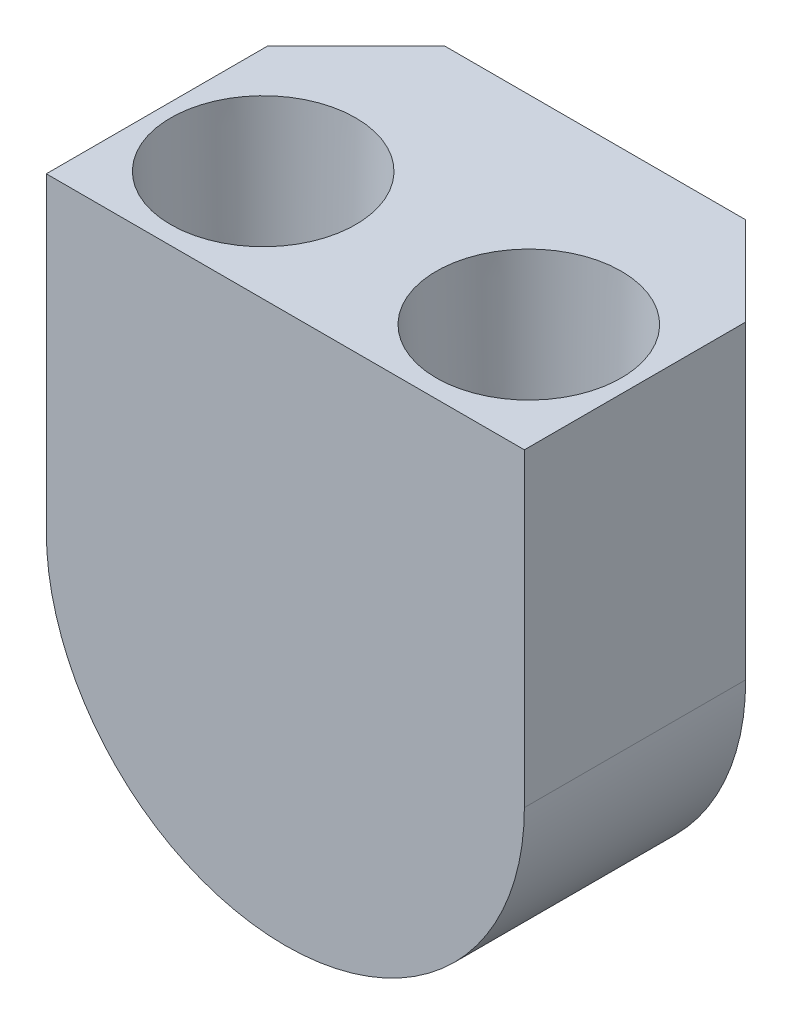
ISO-10303-21;
HEADER;
FILE_DESCRIPTION(('STEP AP214'),'2;1');
FILE_NAME('part.step','',(''),(''),'','','');
FILE_SCHEMA(('AUTOMOTIVE_DESIGN { 1 0 10303 214 1 1 1 1 }'));
ENDSEC;
DATA;
#1=APPLICATION_CONTEXT('core data for automotive mechanical design processes');
#2=APPLICATION_PROTOCOL_DEFINITION('international standard','automotive_design',2000,#1);
#3=PRODUCT_CONTEXT('',#1,'mechanical');
#4=PRODUCT('Part','Part','',(#3));
#5=PRODUCT_RELATED_PRODUCT_CATEGORY('part','',(#4));
#6=PRODUCT_DEFINITION_FORMATION('','',#4);
#7=PRODUCT_DEFINITION_CONTEXT('part definition',#1,'design');
#8=PRODUCT_DEFINITION('design','',#6,#7);
#9=PRODUCT_DEFINITION_SHAPE('','',#8);
#10=(LENGTH_UNIT() NAMED_UNIT(*) SI_UNIT(.MILLI.,.METRE.));
#11=(NAMED_UNIT(*) PLANE_ANGLE_UNIT() SI_UNIT($,.RADIAN.));
#12=(NAMED_UNIT(*) SI_UNIT($,.STERADIAN.) SOLID_ANGLE_UNIT());
#13=UNCERTAINTY_MEASURE_WITH_UNIT(LENGTH_MEASURE(1.E-05),#10,'distance_accuracy_value','');
#14=(GEOMETRIC_REPRESENTATION_CONTEXT(3) GLOBAL_UNCERTAINTY_ASSIGNED_CONTEXT((#13)) GLOBAL_UNIT_ASSIGNED_CONTEXT((#10,
#11,#12)) REPRESENTATION_CONTEXT('',''));
#15=CARTESIAN_POINT('',(0.,0.,0.));
#16=DIRECTION('',(0.,0.,1.));
#17=DIRECTION('',(1.,0.,0.));
#18=AXIS2_PLACEMENT_3D('',#15,#16,#17);
#19=CARTESIAN_POINT('',(15.7034932043588,8.33838720500601,-8.89000000000006));
#20=DIRECTION('',(0.,0.,-0.999999999999991));
#21=DIRECTION('',(-0.468975658324345,0.883211091358825,0.));
#22=AXIS2_PLACEMENT_3D('',#19,#20,#21);
#23=PLANE('',#22);
#24=CARTESIAN_POINT('',(-0.837419567709552,0.268318359393671,-8.89000000000006));
#25=DIRECTION('',(0.,0.,-0.999999999999991));
#26=DIRECTION('',(0.,1.,0.));
#27=AXIS2_PLACEMENT_3D('',#24,#25,#26);
#28=CIRCLE('',#27,4.31799999999999);
#29=CARTESIAN_POINT('',(3.48058043229043,0.268318359393671,-8.89000000000006));
#30=VERTEX_POINT('',#29);
#31=CARTESIAN_POINT('',(-5.15541956770954,0.268318359393671,-8.89000000000006));
#32=VERTEX_POINT('',#31);
#33=EDGE_CURVE('E149',#30,#32,#28,.T.);
#34=ORIENTED_EDGE('',*,*,#33,.T.);
#35=DIRECTION('',(0.,1.,0.));
#36=VECTOR('',#35,1.);
#37=CARTESIAN_POINT('',(-5.15541956770954,8.33838720500601,-8.89000000000006));
#38=LINE('',#37,#36);
#39=CARTESIAN_POINT('',(-5.15541956770954,9.15831835939374,-8.89000000000006));
#40=VERTEX_POINT('',#39);
#41=EDGE_CURVE('E151',#32,#40,#38,.T.);
#42=ORIENTED_EDGE('',*,*,#41,.T.);
#43=DIRECTION('',(-1.,0.,0.));
#44=VECTOR('',#43,1.);
#45=CARTESIAN_POINT('',(6.02058043229044,9.15831835939374,-8.89000000000006));
#46=LINE('',#45,#44);
#47=CARTESIAN_POINT('',(3.48058043229043,9.15831835939374,-8.89000000000006));
#48=VERTEX_POINT('',#47);
#49=EDGE_CURVE('E118',#48,#40,#46,.T.);
#50=ORIENTED_EDGE('',*,*,#49,.F.);
#51=DIRECTION('',(0.,-1.,0.));
#52=VECTOR('',#51,1.);
#53=CARTESIAN_POINT('',(3.48058043229043,8.33838720500601,-8.89000000000006));
#54=LINE('',#53,#52);
#55=EDGE_CURVE('E147',#48,#30,#54,.T.);
#56=ORIENTED_EDGE('',*,*,#55,.T.);
#57=EDGE_LOOP('',(#34,#42,#50,#56));
#58=FACE_BOUND('',#57,.T.);
#59=ADVANCED_FACE('F53',(#58),#23,.T.);
#60=CARTESIAN_POINT('',(-0.837419567709552,0.268318359393671,0.));
#61=DIRECTION('',(0.,0.,0.999999999999992));
#62=DIRECTION('',(1.,0.,0.));
#63=AXIS2_PLACEMENT_3D('',#60,#61,#62);
#64=PLANE('',#63);
#65=DIRECTION('',(0.,-1.,0.));
#66=VECTOR('',#65,1.);
#67=CARTESIAN_POINT('',(-7.69541956770955,9.15831835939374,0.));
#68=LINE('',#67,#66);
#69=CARTESIAN_POINT('',(-7.69541956770955,9.15831835939374,0.));
#70=VERTEX_POINT('',#69);
#71=CARTESIAN_POINT('',(-7.69541956770955,0.268318359393671,0.));
#72=VERTEX_POINT('',#71);
#73=EDGE_CURVE('E121',#70,#72,#68,.T.);
#74=ORIENTED_EDGE('',*,*,#73,.T.);
#75=CARTESIAN_POINT('',(-0.837419567709552,0.268318359393671,0.));
#76=DIRECTION('',(0.,0.,0.999999999999992));
#77=DIRECTION('',(1.,0.,0.));
#78=AXIS2_PLACEMENT_3D('',#75,#76,#77);
#79=CIRCLE('',#78,6.85799999999999);
#80=CARTESIAN_POINT('',(6.02058043229044,0.268318359393671,0.));
#81=VERTEX_POINT('',#80);
#82=EDGE_CURVE('E126',#72,#81,#79,.T.);
#83=ORIENTED_EDGE('',*,*,#82,.T.);
#84=DIRECTION('',(0.,1.,0.));
#85=VECTOR('',#84,1.);
#86=CARTESIAN_POINT('',(6.02058043229044,0.268318359393671,0.));
#87=LINE('',#86,#85);
#88=CARTESIAN_POINT('',(6.02058043229044,9.15831835939374,0.));
#89=VERTEX_POINT('',#88);
#90=EDGE_CURVE('E131',#81,#89,#87,.T.);
#91=ORIENTED_EDGE('',*,*,#90,.T.);
#92=DIRECTION('',(-1.,0.,0.));
#93=VECTOR('',#92,1.);
#94=CARTESIAN_POINT('',(6.02058043229044,9.15831835939374,0.));
#95=LINE('',#94,#93);
#96=EDGE_CURVE('E111',#89,#70,#95,.T.);
#97=ORIENTED_EDGE('',*,*,#96,.T.);
#98=EDGE_LOOP('',(#74,#83,#91,#97));
#99=FACE_BOUND('',#98,.T.);
#100=ADVANCED_FACE('F129',(#99),#64,.T.);
#101=CARTESIAN_POINT('',(-0.837419567709552,0.268318359393671,-33.5836816677517));
#102=DIRECTION('',(0.,0.,0.999999999999992));
#103=DIRECTION('',(1.,0.,0.));
#104=AXIS2_PLACEMENT_3D('',#101,#102,#103);
#105=CYLINDRICAL_SURFACE('',#104,6.85799999999999);
#106=DIRECTION('',(0.,0.,0.999999999999992));
#107=VECTOR('',#106,1.);
#108=CARTESIAN_POINT('',(-7.69541956770955,0.268318359393671,-33.5836816677517));
#109=LINE('',#108,#107);
#110=CARTESIAN_POINT('',(-7.69541956770955,0.268318359393671,-6.3500000000003));
#111=VERTEX_POINT('',#110);
#112=EDGE_CURVE('E117',#111,#72,#109,.T.);
#113=ORIENTED_EDGE('',*,*,#112,.F.);
#114=CARTESIAN_POINT('',(-0.837419567709552,0.268318359393671,-6.3500000000003));
#115=DIRECTION('',(0.,0.,-0.999999999999992));
#116=DIRECTION('',(-1.,0.,0.));
#117=AXIS2_PLACEMENT_3D('',#114,#115,#116);
#118=CIRCLE('',#117,6.85799999999999);
#119=CARTESIAN_POINT('',(6.02058043229044,0.268318359393671,-6.3500000000003));
#120=VERTEX_POINT('',#119);
#121=EDGE_CURVE('E62',#111,#120,#118,.F.);
#122=ORIENTED_EDGE('',*,*,#121,.T.);
#123=DIRECTION('',(0.,0.,0.999999999999992));
#124=VECTOR('',#123,1.);
#125=CARTESIAN_POINT('',(6.02058043229044,0.268318359393671,-33.5836816677517));
#126=LINE('',#125,#124);
#127=EDGE_CURVE('E132',#120,#81,#126,.T.);
#128=ORIENTED_EDGE('',*,*,#127,.T.);
#129=ORIENTED_EDGE('',*,*,#82,.F.);
#130=EDGE_LOOP('',(#113,#122,#128,#129));
#131=FACE_BOUND('',#130,.T.);
#132=ADVANCED_FACE('F187',(#131),#105,.T.);
#133=CARTESIAN_POINT('',(6.02058043229044,0.268318359393671,-33.5836816677517));
#134=DIRECTION('',(1.,0.,0.));
#135=DIRECTION('',(0.,1.,0.));
#136=AXIS2_PLACEMENT_3D('',#133,#134,#135);
#137=PLANE('',#136);
#138=ORIENTED_EDGE('',*,*,#127,.F.);
#139=DIRECTION('',(0.,1.,0.));
#140=VECTOR('',#139,1.);
#141=CARTESIAN_POINT('',(6.02058043229044,0.268318359393671,-6.3500000000003));
#142=LINE('',#141,#140);
#143=CARTESIAN_POINT('',(6.02058043229044,9.15831835939374,-6.3500000000003));
#144=VERTEX_POINT('',#143);
#145=EDGE_CURVE('E14',#120,#144,#142,.T.);
#146=ORIENTED_EDGE('',*,*,#145,.T.);
#147=DIRECTION('',(0.,0.,0.999999999999992));
#148=VECTOR('',#147,1.);
#149=CARTESIAN_POINT('',(6.02058043229044,9.15831835939374,-33.5836816677517));
#150=LINE('',#149,#148);
#151=EDGE_CURVE('E134',#144,#89,#150,.T.);
#152=ORIENTED_EDGE('',*,*,#151,.T.);
#153=ORIENTED_EDGE('',*,*,#90,.F.);
#154=EDGE_LOOP('',(#138,#146,#152,#153));
#155=FACE_BOUND('',#154,.T.);
#156=ADVANCED_FACE('F180',(#155),#137,.T.);
#157=CARTESIAN_POINT('',(6.02058043229044,9.15831835939374,-33.5836816677517));
#158=DIRECTION('',(0.,1.,0.));
#159=DIRECTION('',(-1.,0.,0.));
#160=AXIS2_PLACEMENT_3D('',#157,#158,#159);
#161=PLANE('',#160);
#162=CARTESIAN_POINT('',(2.97258043224281,9.15831835939374,-3.17499999999971));
#163=DIRECTION('',(0.,1.,0.));
#164=DIRECTION('',(0.,0.,0.999999999999992));
#165=AXIS2_PLACEMENT_3D('',#162,#163,#164);
#166=CIRCLE('',#165,2.65430000000001);
#167=CARTESIAN_POINT('',(2.97258043224281,9.15831835939374,-0.520699999999717));
#168=VERTEX_POINT('',#167);
#169=EDGE_CURVE('E170',#168,#168,#166,.T.);
#170=ORIENTED_EDGE('',*,*,#169,.F.);
#171=EDGE_LOOP('',(#170));
#172=FACE_BOUND('',#171,.T.);
#173=CARTESIAN_POINT('',(-4.64741956775718,9.15831835939374,-3.17499999999971));
#174=DIRECTION('',(0.,1.,0.));
#175=DIRECTION('',(0.,0.,0.999999999999992));
#176=AXIS2_PLACEMENT_3D('',#173,#174,#175);
#177=CIRCLE('',#176,2.65430000000001);
#178=CARTESIAN_POINT('',(-4.64741956775718,9.15831835939374,-0.520699999999716));
#179=VERTEX_POINT('',#178);
#180=EDGE_CURVE('E162',#179,#179,#177,.T.);
#181=ORIENTED_EDGE('',*,*,#180,.F.);
#182=EDGE_LOOP('',(#181));
#183=FACE_BOUND('',#182,.T.);
#184=ORIENTED_EDGE('',*,*,#49,.T.);
#185=DIRECTION('',(0.707106781186549,0.,-0.707106781186542));
#186=VECTOR('',#185,1.);
#187=CARTESIAN_POINT('',(12.7794212661665,9.15831835939374,-26.8248408338758));
#188=LINE('',#187,#186);
#189=CARTESIAN_POINT('',(-7.69541956770955,9.15831835939374,-6.3500000000003));
#190=VERTEX_POINT('',#189);
#191=EDGE_CURVE('E113',#40,#190,#188,.F.);
#192=ORIENTED_EDGE('',*,*,#191,.T.);
#193=DIRECTION('',(0.,0.,0.999999999999992));
#194=VECTOR('',#193,1.);
#195=CARTESIAN_POINT('',(-7.69541956770955,9.15831835939374,-33.5836816677517));
#196=LINE('',#195,#194);
#197=EDGE_CURVE('E106',#190,#70,#196,.T.);
#198=ORIENTED_EDGE('',*,*,#197,.T.);
#199=ORIENTED_EDGE('',*,*,#96,.F.);
#200=ORIENTED_EDGE('',*,*,#151,.F.);
#201=DIRECTION('',(0.707106781186549,0.,0.707106781186542));
#202=VECTOR('',#201,1.);
#203=CARTESIAN_POINT('',(-7.59626040158554,9.15831835939374,-19.9668408338756));
#204=LINE('',#203,#202);
#205=EDGE_CURVE('E153',#144,#48,#204,.F.);
#206=ORIENTED_EDGE('',*,*,#205,.T.);
#207=EDGE_LOOP('',(#184,#192,#198,#199,#200,#206));
#208=FACE_BOUND('',#207,.T.);
#209=ADVANCED_FACE('F109',(#172,#183,#208),#161,.T.);
#210=CARTESIAN_POINT('',(-7.69541956770955,9.15831835939374,-33.5836816677517));
#211=DIRECTION('',(-1.,0.,0.));
#212=DIRECTION('',(0.,0.,0.999999999999992));
#213=AXIS2_PLACEMENT_3D('',#210,#211,#212);
#214=PLANE('',#213);
#215=ORIENTED_EDGE('',*,*,#197,.F.);
#216=DIRECTION('',(0.,-1.,0.));
#217=VECTOR('',#216,1.);
#218=CARTESIAN_POINT('',(-7.69541956770955,9.15831835939374,-6.3500000000003));
#219=LINE('',#218,#217);
#220=EDGE_CURVE('E145',#190,#111,#219,.T.);
#221=ORIENTED_EDGE('',*,*,#220,.T.);
#222=ORIENTED_EDGE('',*,*,#112,.T.);
#223=ORIENTED_EDGE('',*,*,#73,.F.);
#224=EDGE_LOOP('',(#215,#221,#222,#223));
#225=FACE_BOUND('',#224,.T.);
#226=ADVANCED_FACE('F122',(#225),#214,.T.);
#227=CARTESIAN_POINT('',(6.02058043229044,0.268318359393671,-6.3500000000003));
#228=DIRECTION('',(-0.707106781186546,0.,0.707106781186545));
#229=DIRECTION('',(0.,1.,0.));
#230=AXIS2_PLACEMENT_3D('',#227,#228,#229);
#231=PLANE('',#230);
#232=ORIENTED_EDGE('',*,*,#205,.F.);
#233=ORIENTED_EDGE('',*,*,#145,.F.);
#234=DIRECTION('',(0.707106781186549,0.,0.707106781186542));
#235=VECTOR('',#234,1.);
#236=CARTESIAN_POINT('',(3.48058043229043,0.268318359393671,-8.89000000000006));
#237=LINE('',#236,#235);
#238=EDGE_CURVE('E57',#30,#120,#237,.T.);
#239=ORIENTED_EDGE('',*,*,#238,.F.);
#240=ORIENTED_EDGE('',*,*,#55,.F.);
#241=EDGE_LOOP('',(#232,#233,#239,#240));
#242=FACE_BOUND('',#241,.T.);
#243=ADVANCED_FACE('F55',(#242),#231,.F.);
#244=CARTESIAN_POINT('',(-0.837419567709552,0.268318359393671,-6.3500000000003));
#245=DIRECTION('',(0.,0.,0.999999999999992));
#246=DIRECTION('',(1.,0.,0.));
#247=AXIS2_PLACEMENT_3D('',#244,#245,#246);
#248=CONICAL_SURFACE('',#247,6.85799999999999,0.785398163397451);
#249=ORIENTED_EDGE('',*,*,#238,.T.);
#250=ORIENTED_EDGE('',*,*,#121,.F.);
#251=DIRECTION('',(-0.707106781186549,0.,0.707106781186541));
#252=VECTOR('',#251,1.);
#253=CARTESIAN_POINT('',(-5.15541956770954,0.268318359393671,-8.89000000000006));
#254=LINE('',#253,#252);
#255=EDGE_CURVE('E156',#32,#111,#254,.T.);
#256=ORIENTED_EDGE('',*,*,#255,.F.);
#257=ORIENTED_EDGE('',*,*,#33,.F.);
#258=EDGE_LOOP('',(#249,#250,#256,#257));
#259=FACE_BOUND('',#258,.T.);
#260=ADVANCED_FACE('F201',(#259),#248,.T.);
#261=CARTESIAN_POINT('',(-7.69541956770955,9.15831835939374,-6.3500000000003));
#262=DIRECTION('',(0.707106781186546,0.,0.707106781186545));
#263=DIRECTION('',(0.,-1.,0.));
#264=AXIS2_PLACEMENT_3D('',#261,#262,#263);
#265=PLANE('',#264);
#266=ORIENTED_EDGE('',*,*,#191,.F.);
#267=ORIENTED_EDGE('',*,*,#41,.F.);
#268=ORIENTED_EDGE('',*,*,#255,.T.);
#269=ORIENTED_EDGE('',*,*,#220,.F.);
#270=EDGE_LOOP('',(#266,#267,#268,#269));
#271=FACE_BOUND('',#270,.T.);
#272=ADVANCED_FACE('F198',(#271),#265,.F.);
#273=CARTESIAN_POINT('',(-4.64741956775719,5.34831835939364,-3.17499999999971));
#274=DIRECTION('',(0.,-1.,0.));
#275=DIRECTION('',(0.,0.,-0.999999999999992));
#276=AXIS2_PLACEMENT_3D('',#273,#274,#275);
#277=PLANE('',#276);
#278=CARTESIAN_POINT('',(-4.64741956775719,5.34831835939364,-3.17499999999971));
#279=DIRECTION('',(0.,1.,0.));
#280=DIRECTION('',(0.,0.,0.999999999999992));
#281=AXIS2_PLACEMENT_3D('',#278,#279,#280);
#282=CIRCLE('',#281,2.52730000000001);
#283=CARTESIAN_POINT('',(-4.64741956775719,5.34831835939364,-0.647699999999714));
#284=VERTEX_POINT('',#283);
#285=EDGE_CURVE('E138',#284,#284,#282,.T.);
#286=ORIENTED_EDGE('',*,*,#285,.T.);
#287=EDGE_LOOP('',(#286));
#288=FACE_BOUND('',#287,.T.);
#289=ADVANCED_FACE('F200',(#288),#277,.F.);
#290=CARTESIAN_POINT('',(-4.64741956775718,9.15831835939374,-3.17499999999971));
#291=DIRECTION('',(0.,1.,0.));
#292=DIRECTION('',(0.,0.,0.999999999999992));
#293=AXIS2_PLACEMENT_3D('',#290,#291,#292);
#294=CONICAL_SURFACE('',#293,2.65430000000001,0.033320995878247);
#295=ORIENTED_EDGE('',*,*,#285,.F.);
#296=EDGE_LOOP('',(#295));
#297=FACE_BOUND('',#296,.T.);
#298=ORIENTED_EDGE('',*,*,#180,.T.);
#299=EDGE_LOOP('',(#298));
#300=FACE_BOUND('',#299,.T.);
#301=ADVANCED_FACE('F245',(#297,#300),#294,.F.);
#302=CARTESIAN_POINT('',(2.97258043224281,5.34831835939364,-3.17499999999971));
#303=DIRECTION('',(0.,-1.,0.));
#304=DIRECTION('',(0.,0.,-0.999999999999992));
#305=AXIS2_PLACEMENT_3D('',#302,#303,#304);
#306=PLANE('',#305);
#307=CARTESIAN_POINT('',(2.97258043224281,5.34831835939364,-3.17499999999971));
#308=DIRECTION('',(0.,1.,0.));
#309=DIRECTION('',(0.,0.,0.999999999999992));
#310=AXIS2_PLACEMENT_3D('',#307,#308,#309);
#311=CIRCLE('',#310,2.52730000000001);
#312=CARTESIAN_POINT('',(2.97258043224281,5.34831835939364,-0.647699999999714));
#313=VERTEX_POINT('',#312);
#314=EDGE_CURVE('E166',#313,#313,#311,.T.);
#315=ORIENTED_EDGE('',*,*,#314,.T.);
#316=EDGE_LOOP('',(#315));
#317=FACE_BOUND('',#316,.T.);
#318=ADVANCED_FACE('F252',(#317),#306,.F.);
#319=CARTESIAN_POINT('',(2.97258043224281,9.15831835939374,-3.17499999999971));
#320=DIRECTION('',(0.,1.,0.));
#321=DIRECTION('',(0.,0.,0.999999999999992));
#322=AXIS2_PLACEMENT_3D('',#319,#320,#321);
#323=CONICAL_SURFACE('',#322,2.65430000000001,0.0333209958782469);
#324=ORIENTED_EDGE('',*,*,#314,.F.);
#325=EDGE_LOOP('',(#324));
#326=FACE_BOUND('',#325,.T.);
#327=ORIENTED_EDGE('',*,*,#169,.T.);
#328=EDGE_LOOP('',(#327));
#329=FACE_BOUND('',#328,.T.);
#330=ADVANCED_FACE('F176',(#326,#329),#323,.F.);
#331=CLOSED_SHELL('',(#59,#100,#132,#156,#209,#226,#243,#260,#272,#289,#301,#318,#330));
#332=MANIFOLD_SOLID_BREP('B2',#331);
#333=ADVANCED_BREP_SHAPE_REPRESENTATION('',(#18,#332),#14);
#334=SHAPE_DEFINITION_REPRESENTATION(#9,#333);
ENDSEC;
END-ISO-10303-21;
